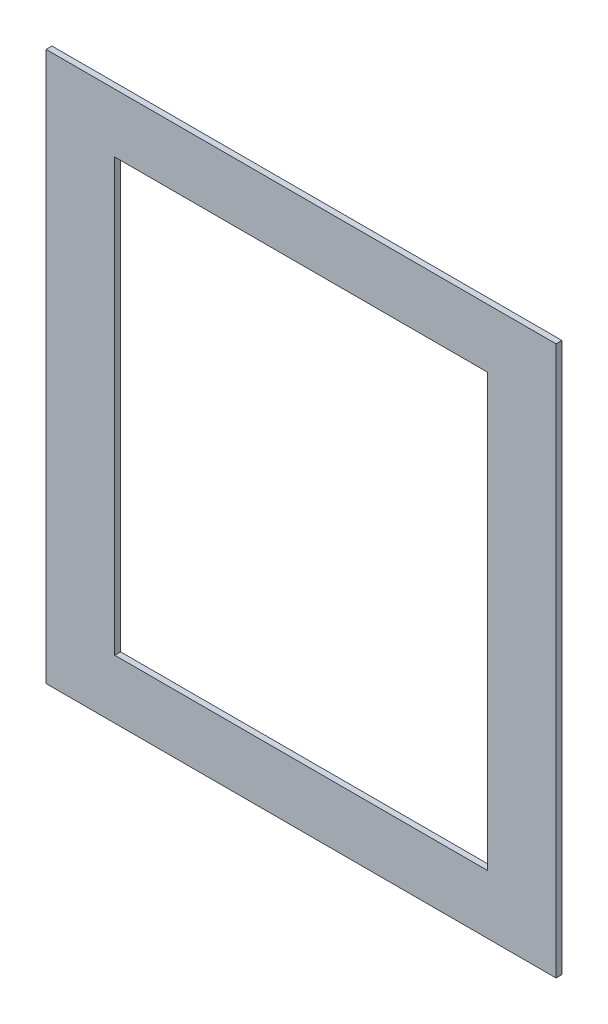
ISO-10303-21;
HEADER;
FILE_DESCRIPTION(('STEP AP214'),'2;1');
FILE_NAME('part.step','',(''),(''),'','','');
FILE_SCHEMA(('AUTOMOTIVE_DESIGN { 1 0 10303 214 1 1 1 1 }'));
ENDSEC;
DATA;
#1=APPLICATION_CONTEXT('core data for automotive mechanical design processes');
#2=APPLICATION_PROTOCOL_DEFINITION('international standard','automotive_design',2000,#1);
#3=PRODUCT_CONTEXT('',#1,'mechanical');
#4=PRODUCT('Part','Part','',(#3));
#5=PRODUCT_RELATED_PRODUCT_CATEGORY('part','',(#4));
#6=PRODUCT_DEFINITION_FORMATION('','',#4);
#7=PRODUCT_DEFINITION_CONTEXT('part definition',#1,'design');
#8=PRODUCT_DEFINITION('design','',#6,#7);
#9=PRODUCT_DEFINITION_SHAPE('','',#8);
#10=(LENGTH_UNIT() NAMED_UNIT(*) SI_UNIT(.MILLI.,.METRE.));
#11=(NAMED_UNIT(*) PLANE_ANGLE_UNIT() SI_UNIT($,.RADIAN.));
#12=(NAMED_UNIT(*) SI_UNIT($,.STERADIAN.) SOLID_ANGLE_UNIT());
#13=UNCERTAINTY_MEASURE_WITH_UNIT(LENGTH_MEASURE(1.E-05),#10,'distance_accuracy_value','');
#14=(GEOMETRIC_REPRESENTATION_CONTEXT(3) GLOBAL_UNCERTAINTY_ASSIGNED_CONTEXT((#13)) GLOBAL_UNIT_ASSIGNED_CONTEXT((#10,
#11,#12)) REPRESENTATION_CONTEXT('',''));
#15=CARTESIAN_POINT('',(0.,0.,0.));
#16=DIRECTION('',(0.,0.,1.));
#17=DIRECTION('',(1.,0.,0.));
#18=AXIS2_PLACEMENT_3D('',#15,#16,#17);
#19=CARTESIAN_POINT('',(0.,0.,6.));
#20=DIRECTION('',(0.,0.,1.));
#21=DIRECTION('',(1.,0.,0.));
#22=AXIS2_PLACEMENT_3D('',#19,#20,#21);
#23=PLANE('',#22);
#24=DIRECTION('',(0.,-1.,0.));
#25=VECTOR('',#24,1.);
#26=CARTESIAN_POINT('',(-57.6720828317545,540.464227839491,6.));
#27=LINE('',#26,#25);
#28=CARTESIAN_POINT('',(-57.6720828317545,540.464227839491,6.));
#29=VERTEX_POINT('',#28);
#30=CARTESIAN_POINT('',(-57.6720828317544,-19.5357721605093,6.));
#31=VERTEX_POINT('',#30);
#32=EDGE_CURVE('E136',#29,#31,#27,.T.);
#33=ORIENTED_EDGE('',*,*,#32,.T.);
#34=DIRECTION('',(1.,0.,0.));
#35=VECTOR('',#34,1.);
#36=CARTESIAN_POINT('',(-57.6720828317544,-19.5357721605093,6.));
#37=LINE('',#36,#35);
#38=CARTESIAN_POINT('',(462.327917168246,-19.5357721605093,6.));
#39=VERTEX_POINT('',#38);
#40=EDGE_CURVE('E139',#31,#39,#37,.T.);
#41=ORIENTED_EDGE('',*,*,#40,.T.);
#42=DIRECTION('',(0.,1.,0.));
#43=VECTOR('',#42,1.);
#44=CARTESIAN_POINT('',(462.327917168246,540.464227839491,6.));
#45=LINE('',#44,#43);
#46=CARTESIAN_POINT('',(462.327917168246,540.464227839491,6.));
#47=VERTEX_POINT('',#46);
#48=EDGE_CURVE('E142',#39,#47,#45,.T.);
#49=ORIENTED_EDGE('',*,*,#48,.T.);
#50=DIRECTION('',(-1.,0.,0.));
#51=VECTOR('',#50,1.);
#52=CARTESIAN_POINT('',(-57.6720828317545,540.464227839491,6.));
#53=LINE('',#52,#51);
#54=EDGE_CURVE('E144',#47,#29,#53,.T.);
#55=ORIENTED_EDGE('',*,*,#54,.T.);
#56=EDGE_LOOP('',(#33,#41,#49,#55));
#57=FACE_BOUND('',#56,.T.);
#58=DIRECTION('',(0.,-1.,0.));
#59=VECTOR('',#58,1.);
#60=CARTESIAN_POINT('',(12.3279171682455,480.464227839491,6.));
#61=LINE('',#60,#59);
#62=CARTESIAN_POINT('',(12.3279171682455,480.464227839491,6.));
#63=VERTEX_POINT('',#62);
#64=CARTESIAN_POINT('',(12.3279171682456,40.4642278394907,6.));
#65=VERTEX_POINT('',#64);
#66=EDGE_CURVE('E108',#63,#65,#61,.T.);
#67=ORIENTED_EDGE('',*,*,#66,.F.);
#68=DIRECTION('',(-1.,0.,0.));
#69=VECTOR('',#68,1.);
#70=CARTESIAN_POINT('',(12.3279171682455,480.464227839491,6.));
#71=LINE('',#70,#69);
#72=CARTESIAN_POINT('',(392.327917168246,480.464227839491,6.));
#73=VERTEX_POINT('',#72);
#74=EDGE_CURVE('E100',#73,#63,#71,.T.);
#75=ORIENTED_EDGE('',*,*,#74,.F.);
#76=DIRECTION('',(0.,1.,0.));
#77=VECTOR('',#76,1.);
#78=CARTESIAN_POINT('',(392.327917168246,480.464227839491,6.));
#79=LINE('',#78,#77);
#80=CARTESIAN_POINT('',(392.327917168246,40.4642278394907,6.));
#81=VERTEX_POINT('',#80);
#82=EDGE_CURVE('E122',#81,#73,#79,.T.);
#83=ORIENTED_EDGE('',*,*,#82,.F.);
#84=DIRECTION('',(1.,0.,0.));
#85=VECTOR('',#84,1.);
#86=CARTESIAN_POINT('',(12.3279171682456,40.4642278394907,6.));
#87=LINE('',#86,#85);
#88=EDGE_CURVE('E120',#65,#81,#87,.T.);
#89=ORIENTED_EDGE('',*,*,#88,.F.);
#90=EDGE_LOOP('',(#67,#75,#83,#89));
#91=FACE_BOUND('',#90,.T.);
#92=ADVANCED_FACE('F35',(#57,#91),#23,.T.);
#93=CARTESIAN_POINT('',(0.,0.,0.));
#94=DIRECTION('',(0.,0.,1.));
#95=DIRECTION('',(1.,0.,0.));
#96=AXIS2_PLACEMENT_3D('',#93,#94,#95);
#97=PLANE('',#96);
#98=DIRECTION('',(0.,-1.,0.));
#99=VECTOR('',#98,1.);
#100=CARTESIAN_POINT('',(-57.6720828317545,540.464227839491,0.));
#101=LINE('',#100,#99);
#102=CARTESIAN_POINT('',(-57.6720828317545,540.464227839491,0.));
#103=VERTEX_POINT('',#102);
#104=CARTESIAN_POINT('',(-57.6720828317544,-19.5357721605093,0.));
#105=VERTEX_POINT('',#104);
#106=EDGE_CURVE('E116',#103,#105,#101,.T.);
#107=ORIENTED_EDGE('',*,*,#106,.F.);
#108=DIRECTION('',(-1.,0.,0.));
#109=VECTOR('',#108,1.);
#110=CARTESIAN_POINT('',(-57.6720828317545,540.464227839491,0.));
#111=LINE('',#110,#109);
#112=CARTESIAN_POINT('',(462.327917168246,540.464227839491,0.));
#113=VERTEX_POINT('',#112);
#114=EDGE_CURVE('E140',#113,#103,#111,.T.);
#115=ORIENTED_EDGE('',*,*,#114,.F.);
#116=DIRECTION('',(0.,1.,0.));
#117=VECTOR('',#116,1.);
#118=CARTESIAN_POINT('',(462.327917168246,540.464227839491,0.));
#119=LINE('',#118,#117);
#120=CARTESIAN_POINT('',(462.327917168246,-19.5357721605093,0.));
#121=VERTEX_POINT('',#120);
#122=EDGE_CURVE('E151',#121,#113,#119,.T.);
#123=ORIENTED_EDGE('',*,*,#122,.F.);
#124=DIRECTION('',(1.,0.,0.));
#125=VECTOR('',#124,1.);
#126=CARTESIAN_POINT('',(-57.6720828317544,-19.5357721605093,0.));
#127=LINE('',#126,#125);
#128=EDGE_CURVE('E149',#105,#121,#127,.T.);
#129=ORIENTED_EDGE('',*,*,#128,.F.);
#130=EDGE_LOOP('',(#107,#115,#123,#129));
#131=FACE_BOUND('',#130,.T.);
#132=DIRECTION('',(-1.,0.,0.));
#133=VECTOR('',#132,1.);
#134=CARTESIAN_POINT('',(12.3279171682455,480.464227839491,0.));
#135=LINE('',#134,#133);
#136=CARTESIAN_POINT('',(392.327917168246,480.464227839491,0.));
#137=VERTEX_POINT('',#136);
#138=CARTESIAN_POINT('',(12.3279171682455,480.464227839491,0.));
#139=VERTEX_POINT('',#138);
#140=EDGE_CURVE('E58',#137,#139,#135,.T.);
#141=ORIENTED_EDGE('',*,*,#140,.T.);
#142=DIRECTION('',(0.,-1.,0.));
#143=VECTOR('',#142,1.);
#144=CARTESIAN_POINT('',(12.3279171682455,480.464227839491,0.));
#145=LINE('',#144,#143);
#146=CARTESIAN_POINT('',(12.3279171682456,40.4642278394907,0.));
#147=VERTEX_POINT('',#146);
#148=EDGE_CURVE('E115',#139,#147,#145,.T.);
#149=ORIENTED_EDGE('',*,*,#148,.T.);
#150=DIRECTION('',(1.,0.,0.));
#151=VECTOR('',#150,1.);
#152=CARTESIAN_POINT('',(12.3279171682456,40.4642278394907,0.));
#153=LINE('',#152,#151);
#154=CARTESIAN_POINT('',(392.327917168246,40.4642278394907,0.));
#155=VERTEX_POINT('',#154);
#156=EDGE_CURVE('E128',#147,#155,#153,.T.);
#157=ORIENTED_EDGE('',*,*,#156,.T.);
#158=DIRECTION('',(0.,1.,0.));
#159=VECTOR('',#158,1.);
#160=CARTESIAN_POINT('',(392.327917168246,480.464227839491,0.));
#161=LINE('',#160,#159);
#162=EDGE_CURVE('E109',#155,#137,#161,.T.);
#163=ORIENTED_EDGE('',*,*,#162,.T.);
#164=EDGE_LOOP('',(#141,#149,#157,#163));
#165=FACE_BOUND('',#164,.T.);
#166=ADVANCED_FACE('F169',(#131,#165),#97,.F.);
#167=CARTESIAN_POINT('',(-57.6720828317545,540.464227839491,6.));
#168=DIRECTION('',(1.,0.,0.));
#169=DIRECTION('',(0.,1.,0.));
#170=AXIS2_PLACEMENT_3D('',#167,#168,#169);
#171=PLANE('',#170);
#172=ORIENTED_EDGE('',*,*,#106,.T.);
#173=DIRECTION('',(0.,0.,-1.));
#174=VECTOR('',#173,1.);
#175=CARTESIAN_POINT('',(-57.6720828317544,-19.5357721605093,6.));
#176=LINE('',#175,#174);
#177=EDGE_CURVE('E11',#31,#105,#176,.T.);
#178=ORIENTED_EDGE('',*,*,#177,.F.);
#179=ORIENTED_EDGE('',*,*,#32,.F.);
#180=DIRECTION('',(0.,0.,-1.));
#181=VECTOR('',#180,1.);
#182=CARTESIAN_POINT('',(-57.6720828317545,540.464227839491,6.));
#183=LINE('',#182,#181);
#184=EDGE_CURVE('E146',#29,#103,#183,.T.);
#185=ORIENTED_EDGE('',*,*,#184,.T.);
#186=EDGE_LOOP('',(#172,#178,#179,#185));
#187=FACE_BOUND('',#186,.T.);
#188=ADVANCED_FACE('F37',(#187),#171,.F.);
#189=CARTESIAN_POINT('',(-57.6720828317544,-19.5357721605093,6.));
#190=DIRECTION('',(0.,1.,0.));
#191=DIRECTION('',(-1.,0.,0.));
#192=AXIS2_PLACEMENT_3D('',#189,#190,#191);
#193=PLANE('',#192);
#194=ORIENTED_EDGE('',*,*,#128,.T.);
#195=DIRECTION('',(0.,0.,-1.));
#196=VECTOR('',#195,1.);
#197=CARTESIAN_POINT('',(462.327917168246,-19.5357721605093,6.));
#198=LINE('',#197,#196);
#199=EDGE_CURVE('E43',#39,#121,#198,.T.);
#200=ORIENTED_EDGE('',*,*,#199,.F.);
#201=ORIENTED_EDGE('',*,*,#40,.F.);
#202=ORIENTED_EDGE('',*,*,#177,.T.);
#203=EDGE_LOOP('',(#194,#200,#201,#202));
#204=FACE_BOUND('',#203,.T.);
#205=ADVANCED_FACE('F179',(#204),#193,.F.);
#206=CARTESIAN_POINT('',(462.327917168246,540.464227839491,6.));
#207=DIRECTION('',(-1.,0.,0.));
#208=DIRECTION('',(0.,0.,1.));
#209=AXIS2_PLACEMENT_3D('',#206,#207,#208);
#210=PLANE('',#209);
#211=ORIENTED_EDGE('',*,*,#122,.T.);
#212=DIRECTION('',(0.,0.,-1.));
#213=VECTOR('',#212,1.);
#214=CARTESIAN_POINT('',(462.327917168246,540.464227839491,6.));
#215=LINE('',#214,#213);
#216=EDGE_CURVE('E156',#47,#113,#215,.T.);
#217=ORIENTED_EDGE('',*,*,#216,.F.);
#218=ORIENTED_EDGE('',*,*,#48,.F.);
#219=ORIENTED_EDGE('',*,*,#199,.T.);
#220=EDGE_LOOP('',(#211,#217,#218,#219));
#221=FACE_BOUND('',#220,.T.);
#222=ADVANCED_FACE('F163',(#221),#210,.F.);
#223=CARTESIAN_POINT('',(-57.6720828317545,540.464227839491,6.));
#224=DIRECTION('',(0.,-1.,0.));
#225=DIRECTION('',(0.,0.,-1.));
#226=AXIS2_PLACEMENT_3D('',#223,#224,#225);
#227=PLANE('',#226);
#228=ORIENTED_EDGE('',*,*,#114,.T.);
#229=ORIENTED_EDGE('',*,*,#184,.F.);
#230=ORIENTED_EDGE('',*,*,#54,.F.);
#231=ORIENTED_EDGE('',*,*,#216,.T.);
#232=EDGE_LOOP('',(#228,#229,#230,#231));
#233=FACE_BOUND('',#232,.T.);
#234=ADVANCED_FACE('F173',(#233),#227,.F.);
#235=CARTESIAN_POINT('',(12.3279171682455,480.464227839491,6.));
#236=DIRECTION('',(0.,-1.,0.));
#237=DIRECTION('',(0.,0.,-1.));
#238=AXIS2_PLACEMENT_3D('',#235,#236,#237);
#239=PLANE('',#238);
#240=ORIENTED_EDGE('',*,*,#140,.F.);
#241=DIRECTION('',(0.,0.,-1.));
#242=VECTOR('',#241,1.);
#243=CARTESIAN_POINT('',(392.327917168246,480.464227839491,6.));
#244=LINE('',#243,#242);
#245=EDGE_CURVE('E104',#73,#137,#244,.T.);
#246=ORIENTED_EDGE('',*,*,#245,.F.);
#247=ORIENTED_EDGE('',*,*,#74,.T.);
#248=DIRECTION('',(0.,0.,-1.));
#249=VECTOR('',#248,1.);
#250=CARTESIAN_POINT('',(12.3279171682455,480.464227839491,6.));
#251=LINE('',#250,#249);
#252=EDGE_CURVE('E103',#63,#139,#251,.T.);
#253=ORIENTED_EDGE('',*,*,#252,.T.);
#254=EDGE_LOOP('',(#240,#246,#247,#253));
#255=FACE_BOUND('',#254,.T.);
#256=ADVANCED_FACE('F102',(#255),#239,.T.);
#257=CARTESIAN_POINT('',(12.3279171682455,480.464227839491,6.));
#258=DIRECTION('',(1.,0.,0.));
#259=DIRECTION('',(0.,1.,0.));
#260=AXIS2_PLACEMENT_3D('',#257,#258,#259);
#261=PLANE('',#260);
#262=ORIENTED_EDGE('',*,*,#148,.F.);
#263=ORIENTED_EDGE('',*,*,#252,.F.);
#264=ORIENTED_EDGE('',*,*,#66,.T.);
#265=DIRECTION('',(0.,0.,-1.));
#266=VECTOR('',#265,1.);
#267=CARTESIAN_POINT('',(12.3279171682456,40.4642278394907,6.));
#268=LINE('',#267,#266);
#269=EDGE_CURVE('E117',#65,#147,#268,.T.);
#270=ORIENTED_EDGE('',*,*,#269,.T.);
#271=EDGE_LOOP('',(#262,#263,#264,#270));
#272=FACE_BOUND('',#271,.T.);
#273=ADVANCED_FACE('F112',(#272),#261,.T.);
#274=CARTESIAN_POINT('',(12.3279171682456,40.4642278394907,6.));
#275=DIRECTION('',(0.,1.,0.));
#276=DIRECTION('',(0.,0.,1.));
#277=AXIS2_PLACEMENT_3D('',#274,#275,#276);
#278=PLANE('',#277);
#279=ORIENTED_EDGE('',*,*,#156,.F.);
#280=ORIENTED_EDGE('',*,*,#269,.F.);
#281=ORIENTED_EDGE('',*,*,#88,.T.);
#282=DIRECTION('',(0.,0.,-1.));
#283=VECTOR('',#282,1.);
#284=CARTESIAN_POINT('',(392.327917168246,40.4642278394907,6.));
#285=LINE('',#284,#283);
#286=EDGE_CURVE('E50',#81,#155,#285,.T.);
#287=ORIENTED_EDGE('',*,*,#286,.T.);
#288=EDGE_LOOP('',(#279,#280,#281,#287));
#289=FACE_BOUND('',#288,.T.);
#290=ADVANCED_FACE('F202',(#289),#278,.T.);
#291=CARTESIAN_POINT('',(392.327917168246,480.464227839491,6.));
#292=DIRECTION('',(-1.,0.,0.));
#293=DIRECTION('',(0.,-1.,0.));
#294=AXIS2_PLACEMENT_3D('',#291,#292,#293);
#295=PLANE('',#294);
#296=ORIENTED_EDGE('',*,*,#162,.F.);
#297=ORIENTED_EDGE('',*,*,#286,.F.);
#298=ORIENTED_EDGE('',*,*,#82,.T.);
#299=ORIENTED_EDGE('',*,*,#245,.T.);
#300=EDGE_LOOP('',(#296,#297,#298,#299));
#301=FACE_BOUND('',#300,.T.);
#302=ADVANCED_FACE('F206',(#301),#295,.T.);
#303=CLOSED_SHELL('',(#92,#166,#188,#205,#222,#234,#256,#273,#290,#302));
#304=MANIFOLD_SOLID_BREP('B2',#303);
#305=ADVANCED_BREP_SHAPE_REPRESENTATION('',(#18,#304),#14);
#306=SHAPE_DEFINITION_REPRESENTATION(#9,#305);
ENDSEC;
END-ISO-10303-21;
